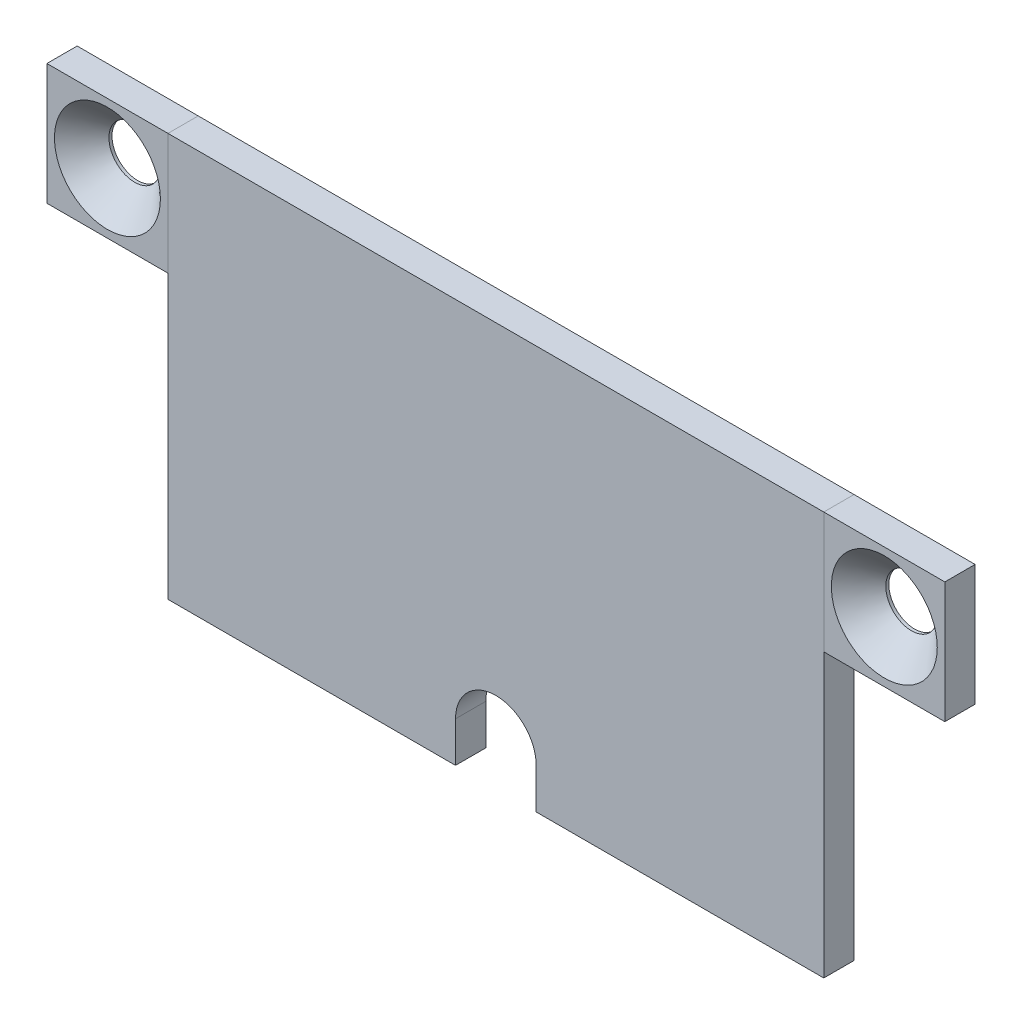
ISO-10303-21;
HEADER;
FILE_DESCRIPTION(('STEP AP214'),'2;1');
FILE_NAME('part.step','',(''),(''),'','','');
FILE_SCHEMA(('AUTOMOTIVE_DESIGN { 1 0 10303 214 1 1 1 1 }'));
ENDSEC;
DATA;
#1=APPLICATION_CONTEXT('core data for automotive mechanical design processes');
#2=APPLICATION_PROTOCOL_DEFINITION('international standard','automotive_design',2000,#1);
#3=PRODUCT_CONTEXT('',#1,'mechanical');
#4=PRODUCT('Part','Part','',(#3));
#5=PRODUCT_RELATED_PRODUCT_CATEGORY('part','',(#4));
#6=PRODUCT_DEFINITION_FORMATION('','',#4);
#7=PRODUCT_DEFINITION_CONTEXT('part definition',#1,'design');
#8=PRODUCT_DEFINITION('design','',#6,#7);
#9=PRODUCT_DEFINITION_SHAPE('','',#8);
#10=(LENGTH_UNIT() NAMED_UNIT(*) SI_UNIT(.MILLI.,.METRE.));
#11=(NAMED_UNIT(*) PLANE_ANGLE_UNIT() SI_UNIT($,.RADIAN.));
#12=(NAMED_UNIT(*) SI_UNIT($,.STERADIAN.) SOLID_ANGLE_UNIT());
#13=UNCERTAINTY_MEASURE_WITH_UNIT(LENGTH_MEASURE(1.E-05),#10,'distance_accuracy_value','');
#14=(GEOMETRIC_REPRESENTATION_CONTEXT(3) GLOBAL_UNCERTAINTY_ASSIGNED_CONTEXT((#13)) GLOBAL_UNIT_ASSIGNED_CONTEXT((#10,
#11,#12)) REPRESENTATION_CONTEXT('',''));
#15=CARTESIAN_POINT('',(0.,0.,0.));
#16=DIRECTION('',(0.,0.,1.));
#17=DIRECTION('',(1.,0.,0.));
#18=AXIS2_PLACEMENT_3D('',#15,#16,#17);
#19=CARTESIAN_POINT('',(30.0943941420636,53.1628696008408,0.));
#20=DIRECTION('',(-1.,0.,0.));
#21=DIRECTION('',(0.,0.,1.));
#22=AXIS2_PLACEMENT_3D('',#19,#20,#21);
#23=PLANE('',#22);
#24=DIRECTION('',(0.,-1.,0.));
#25=VECTOR('',#24,1.);
#26=CARTESIAN_POINT('',(30.0943941420636,53.1628696008408,3.));
#27=LINE('',#26,#25);
#28=CARTESIAN_POINT('',(30.0943941420636,53.1628696008408,3.));
#29=VERTEX_POINT('',#28);
#30=CARTESIAN_POINT('',(30.0943941420636,41.1628696008408,3.));
#31=VERTEX_POINT('',#30);
#32=EDGE_CURVE('E115',#29,#31,#27,.T.);
#33=ORIENTED_EDGE('',*,*,#32,.F.);
#34=DIRECTION('',(0.,0.,1.));
#35=VECTOR('',#34,1.);
#36=CARTESIAN_POINT('',(30.0943941420636,53.1628696008408,0.));
#37=LINE('',#36,#35);
#38=CARTESIAN_POINT('',(30.0943941420636,53.1628696008408,0.));
#39=VERTEX_POINT('',#38);
#40=EDGE_CURVE('E12',#39,#29,#37,.T.);
#41=ORIENTED_EDGE('',*,*,#40,.F.);
#42=DIRECTION('',(0.,-1.,0.));
#43=VECTOR('',#42,1.);
#44=CARTESIAN_POINT('',(30.0943941420636,53.1628696008408,0.));
#45=LINE('',#44,#43);
#46=CARTESIAN_POINT('',(30.0943941420636,41.1628696008408,0.));
#47=VERTEX_POINT('',#46);
#48=EDGE_CURVE('E108',#39,#47,#45,.T.);
#49=ORIENTED_EDGE('',*,*,#48,.T.);
#50=DIRECTION('',(0.,0.,1.));
#51=VECTOR('',#50,1.);
#52=CARTESIAN_POINT('',(30.0943941420636,41.1628696008408,0.));
#53=LINE('',#52,#51);
#54=EDGE_CURVE('E53',#47,#31,#53,.T.);
#55=ORIENTED_EDGE('',*,*,#54,.T.);
#56=EDGE_LOOP('',(#33,#41,#49,#55));
#57=FACE_BOUND('',#56,.T.);
#58=ADVANCED_FACE('F50',(#57),#23,.T.);
#59=CARTESIAN_POINT('',(30.0943941420636,53.1628696008408,0.));
#60=DIRECTION('',(0.,1.,0.));
#61=DIRECTION('',(0.,0.,1.));
#62=AXIS2_PLACEMENT_3D('',#59,#60,#61);
#63=PLANE('',#62);
#64=DIRECTION('',(-1.,0.,0.));
#65=VECTOR('',#64,1.);
#66=CARTESIAN_POINT('',(30.0943941420636,53.1628696008408,3.));
#67=LINE('',#66,#65);
#68=CARTESIAN_POINT('',(42.0943941420636,53.1628696008408,3.));
#69=VERTEX_POINT('',#68);
#70=EDGE_CURVE('E110',#69,#29,#67,.T.);
#71=ORIENTED_EDGE('',*,*,#70,.F.);
#72=DIRECTION('',(0.,0.,1.));
#73=VECTOR('',#72,1.);
#74=CARTESIAN_POINT('',(42.0943941420636,53.1628696008408,0.));
#75=LINE('',#74,#73);
#76=CARTESIAN_POINT('',(42.0943941420636,53.1628696008408,0.));
#77=VERTEX_POINT('',#76);
#78=EDGE_CURVE('E59',#77,#69,#75,.T.);
#79=ORIENTED_EDGE('',*,*,#78,.F.);
#80=DIRECTION('',(-1.,0.,0.));
#81=VECTOR('',#80,1.);
#82=CARTESIAN_POINT('',(30.0943941420636,53.1628696008408,0.));
#83=LINE('',#82,#81);
#84=EDGE_CURVE('E105',#77,#39,#83,.T.);
#85=ORIENTED_EDGE('',*,*,#84,.T.);
#86=ORIENTED_EDGE('',*,*,#40,.T.);
#87=EDGE_LOOP('',(#71,#79,#85,#86));
#88=FACE_BOUND('',#87,.T.);
#89=ADVANCED_FACE('F126',(#88),#63,.T.);
#90=CARTESIAN_POINT('',(42.0943941420636,53.1628696008408,0.));
#91=DIRECTION('',(1.,0.,0.));
#92=DIRECTION('',(0.,0.,-1.));
#93=AXIS2_PLACEMENT_3D('',#90,#91,#92);
#94=PLANE('',#93);
#95=DIRECTION('',(0.,1.,0.));
#96=VECTOR('',#95,1.);
#97=CARTESIAN_POINT('',(42.0943941420636,53.1628696008408,3.));
#98=LINE('',#97,#96);
#99=CARTESIAN_POINT('',(42.0943941420636,41.1628696008408,3.));
#100=VERTEX_POINT('',#99);
#101=EDGE_CURVE('E100',#100,#69,#98,.T.);
#102=ORIENTED_EDGE('',*,*,#101,.F.);
#103=DIRECTION('',(0.,0.,1.));
#104=VECTOR('',#103,1.);
#105=CARTESIAN_POINT('',(42.0943941420636,41.1628696008408,0.));
#106=LINE('',#105,#104);
#107=CARTESIAN_POINT('',(42.0943941420636,41.1628696008408,0.));
#108=VERTEX_POINT('',#107);
#109=EDGE_CURVE('E95',#108,#100,#106,.T.);
#110=ORIENTED_EDGE('',*,*,#109,.F.);
#111=DIRECTION('',(0.,1.,0.));
#112=VECTOR('',#111,1.);
#113=CARTESIAN_POINT('',(42.0943941420636,53.1628696008408,0.));
#114=LINE('',#113,#112);
#115=EDGE_CURVE('E98',#108,#77,#114,.T.);
#116=ORIENTED_EDGE('',*,*,#115,.T.);
#117=ORIENTED_EDGE('',*,*,#78,.T.);
#118=EDGE_LOOP('',(#102,#110,#116,#117));
#119=FACE_BOUND('',#118,.T.);
#120=ADVANCED_FACE('F97',(#119),#94,.T.);
#121=CARTESIAN_POINT('',(30.0943941420636,41.1628696008408,0.));
#122=DIRECTION('',(0.,-1.,0.));
#123=DIRECTION('',(0.,0.,-1.));
#124=AXIS2_PLACEMENT_3D('',#121,#122,#123);
#125=PLANE('',#124);
#126=DIRECTION('',(1.,0.,0.));
#127=VECTOR('',#126,1.);
#128=CARTESIAN_POINT('',(30.0943941420636,41.1628696008408,3.));
#129=LINE('',#128,#127);
#130=EDGE_CURVE('E118',#31,#100,#129,.T.);
#131=ORIENTED_EDGE('',*,*,#130,.F.);
#132=ORIENTED_EDGE('',*,*,#54,.F.);
#133=DIRECTION('',(1.,0.,0.));
#134=VECTOR('',#133,1.);
#135=CARTESIAN_POINT('',(30.0943941420636,41.1628696008408,0.));
#136=LINE('',#135,#134);
#137=EDGE_CURVE('E104',#47,#108,#136,.T.);
#138=ORIENTED_EDGE('',*,*,#137,.T.);
#139=ORIENTED_EDGE('',*,*,#109,.T.);
#140=EDGE_LOOP('',(#131,#132,#138,#139));
#141=FACE_BOUND('',#140,.T.);
#142=ADVANCED_FACE('F107',(#141),#125,.T.);
#143=CARTESIAN_POINT('',(0.,0.,0.));
#144=DIRECTION('',(0.,0.,1.));
#145=DIRECTION('',(1.,0.,0.));
#146=AXIS2_PLACEMENT_3D('',#143,#144,#145);
#147=PLANE('',#146);
#148=CARTESIAN_POINT('',(36.0943941420636,47.1628696008408,0.));
#149=DIRECTION('',(0.,0.,1.));
#150=DIRECTION('',(1.,0.,0.));
#151=AXIS2_PLACEMENT_3D('',#148,#149,#150);
#152=CIRCLE('',#151,2.54999998);
#153=CARTESIAN_POINT('',(38.6443941220636,47.1628696008408,0.));
#154=VERTEX_POINT('',#153);
#155=EDGE_CURVE('E119',#154,#154,#152,.T.);
#156=ORIENTED_EDGE('',*,*,#155,.T.);
#157=EDGE_LOOP('',(#156));
#158=FACE_BOUND('',#157,.T.);
#159=ORIENTED_EDGE('',*,*,#48,.F.);
#160=ORIENTED_EDGE('',*,*,#84,.F.);
#161=ORIENTED_EDGE('',*,*,#115,.F.);
#162=ORIENTED_EDGE('',*,*,#137,.F.);
#163=EDGE_LOOP('',(#159,#160,#161,#162));
#164=FACE_BOUND('',#163,.T.);
#165=ADVANCED_FACE('F103',(#158,#164),#147,.F.);
#166=CARTESIAN_POINT('',(0.,0.,3.));
#167=DIRECTION('',(0.,0.,1.));
#168=DIRECTION('',(1.,0.,0.));
#169=AXIS2_PLACEMENT_3D('',#166,#167,#168);
#170=PLANE('',#169);
#171=CARTESIAN_POINT('',(36.0943941420636,47.1628696008408,3.));
#172=DIRECTION('',(0.,0.,1.));
#173=DIRECTION('',(1.,0.,0.));
#174=AXIS2_PLACEMENT_3D('',#171,#172,#173);
#175=CIRCLE('',#174,5.250000041);
#176=CARTESIAN_POINT('',(41.3443941830636,47.1628696008408,3.));
#177=VERTEX_POINT('',#176);
#178=EDGE_CURVE('E162',#177,#177,#175,.T.);
#179=ORIENTED_EDGE('',*,*,#178,.F.);
#180=EDGE_LOOP('',(#179));
#181=FACE_BOUND('',#180,.T.);
#182=ORIENTED_EDGE('',*,*,#32,.T.);
#183=ORIENTED_EDGE('',*,*,#130,.T.);
#184=ORIENTED_EDGE('',*,*,#101,.T.);
#185=ORIENTED_EDGE('',*,*,#70,.T.);
#186=EDGE_LOOP('',(#182,#183,#184,#185));
#187=FACE_BOUND('',#186,.T.);
#188=ADVANCED_FACE('F125',(#181,#187),#170,.T.);
#189=CARTESIAN_POINT('',(36.0943941420636,47.1628696008408,3.));
#190=DIRECTION('',(0.,0.,1.));
#191=DIRECTION('',(1.,0.,0.));
#192=AXIS2_PLACEMENT_3D('',#189,#190,#191);
#193=CYLINDRICAL_SURFACE('',#192,2.54999998);
#194=ORIENTED_EDGE('',*,*,#155,.F.);
#195=EDGE_LOOP('',(#194));
#196=FACE_BOUND('',#195,.T.);
#197=CARTESIAN_POINT('',(36.0943941420636,47.1628696008408,0.299999939000002));
#198=DIRECTION('',(0.,0.,1.));
#199=DIRECTION('',(1.,0.,0.));
#200=AXIS2_PLACEMENT_3D('',#197,#198,#199);
#201=CIRCLE('',#200,2.54999998);
#202=CARTESIAN_POINT('',(38.6443941220636,47.1628696008408,0.299999939000002));
#203=VERTEX_POINT('',#202);
#204=EDGE_CURVE('E159',#203,#203,#201,.T.);
#205=ORIENTED_EDGE('',*,*,#204,.T.);
#206=EDGE_LOOP('',(#205));
#207=FACE_BOUND('',#206,.T.);
#208=ADVANCED_FACE('F144',(#196,#207),#193,.F.);
#209=CARTESIAN_POINT('',(36.0943941420636,47.1628696008408,3.));
#210=DIRECTION('',(0.,0.,1.));
#211=DIRECTION('',(1.,0.,0.));
#212=AXIS2_PLACEMENT_3D('',#209,#210,#211);
#213=CONICAL_SURFACE('',#212,5.250000041,0.785398163397448);
#214=ORIENTED_EDGE('',*,*,#204,.F.);
#215=EDGE_LOOP('',(#214));
#216=FACE_BOUND('',#215,.T.);
#217=ORIENTED_EDGE('',*,*,#178,.T.);
#218=EDGE_LOOP('',(#217));
#219=FACE_BOUND('',#218,.T.);
#220=ADVANCED_FACE('F150',(#216,#219),#213,.F.);
#221=CLOSED_SHELL('',(#58,#89,#120,#142,#165,#188,#208,#220));
#222=MANIFOLD_SOLID_BREP('B2',#221);
#223=CARTESIAN_POINT('',(-34.9056058579364,53.1628696008408,0.));
#224=DIRECTION('',(1.,0.,0.));
#225=DIRECTION('',(0.,0.,-1.));
#226=AXIS2_PLACEMENT_3D('',#223,#224,#225);
#227=PLANE('',#226);
#228=DIRECTION('',(0.,1.,0.));
#229=VECTOR('',#228,1.);
#230=CARTESIAN_POINT('',(-34.9056058579364,53.1628696008408,3.));
#231=LINE('',#230,#229);
#232=CARTESIAN_POINT('',(-34.9056058579364,41.1628696008408,3.));
#233=VERTEX_POINT('',#232);
#234=CARTESIAN_POINT('',(-34.9056058579364,53.1628696008408,3.));
#235=VERTEX_POINT('',#234);
#236=EDGE_CURVE('E284',#233,#235,#231,.T.);
#237=ORIENTED_EDGE('',*,*,#236,.F.);
#238=DIRECTION('',(0.,0.,1.));
#239=VECTOR('',#238,1.);
#240=CARTESIAN_POINT('',(-34.9056058579364,41.1628696008408,0.));
#241=LINE('',#240,#239);
#242=CARTESIAN_POINT('',(-34.9056058579364,41.1628696008408,0.));
#243=VERTEX_POINT('',#242);
#244=EDGE_CURVE('E48',#243,#233,#241,.T.);
#245=ORIENTED_EDGE('',*,*,#244,.F.);
#246=DIRECTION('',(0.,1.,0.));
#247=VECTOR('',#246,1.);
#248=CARTESIAN_POINT('',(-34.9056058579364,53.1628696008408,0.));
#249=LINE('',#248,#247);
#250=CARTESIAN_POINT('',(-34.9056058579364,53.1628696008408,0.));
#251=VERTEX_POINT('',#250);
#252=EDGE_CURVE('E277',#243,#251,#249,.T.);
#253=ORIENTED_EDGE('',*,*,#252,.T.);
#254=DIRECTION('',(0.,0.,1.));
#255=VECTOR('',#254,1.);
#256=CARTESIAN_POINT('',(-34.9056058579364,53.1628696008408,0.));
#257=LINE('',#256,#255);
#258=EDGE_CURVE('E222',#251,#235,#257,.T.);
#259=ORIENTED_EDGE('',*,*,#258,.T.);
#260=EDGE_LOOP('',(#237,#245,#253,#259));
#261=FACE_BOUND('',#260,.T.);
#262=ADVANCED_FACE('F219',(#261),#227,.T.);
#263=CARTESIAN_POINT('',(-34.9056058579364,41.1628696008408,0.));
#264=DIRECTION('',(0.,-1.,0.));
#265=DIRECTION('',(0.,0.,-1.));
#266=AXIS2_PLACEMENT_3D('',#263,#264,#265);
#267=PLANE('',#266);
#268=DIRECTION('',(1.,0.,0.));
#269=VECTOR('',#268,1.);
#270=CARTESIAN_POINT('',(-34.9056058579364,41.1628696008408,3.));
#271=LINE('',#270,#269);
#272=CARTESIAN_POINT('',(-46.9056058579364,41.1628696008408,3.));
#273=VERTEX_POINT('',#272);
#274=EDGE_CURVE('E279',#273,#233,#271,.T.);
#275=ORIENTED_EDGE('',*,*,#274,.F.);
#276=DIRECTION('',(0.,0.,1.));
#277=VECTOR('',#276,1.);
#278=CARTESIAN_POINT('',(-46.9056058579364,41.1628696008408,0.));
#279=LINE('',#278,#277);
#280=CARTESIAN_POINT('',(-46.9056058579364,41.1628696008408,0.));
#281=VERTEX_POINT('',#280);
#282=EDGE_CURVE('E228',#281,#273,#279,.T.);
#283=ORIENTED_EDGE('',*,*,#282,.F.);
#284=DIRECTION('',(1.,0.,0.));
#285=VECTOR('',#284,1.);
#286=CARTESIAN_POINT('',(-34.9056058579364,41.1628696008408,0.));
#287=LINE('',#286,#285);
#288=EDGE_CURVE('E274',#281,#243,#287,.T.);
#289=ORIENTED_EDGE('',*,*,#288,.T.);
#290=ORIENTED_EDGE('',*,*,#244,.T.);
#291=EDGE_LOOP('',(#275,#283,#289,#290));
#292=FACE_BOUND('',#291,.T.);
#293=ADVANCED_FACE('F295',(#292),#267,.T.);
#294=CARTESIAN_POINT('',(-46.9056058579364,53.1628696008408,0.));
#295=DIRECTION('',(-1.,0.,0.));
#296=DIRECTION('',(0.,0.,1.));
#297=AXIS2_PLACEMENT_3D('',#294,#295,#296);
#298=PLANE('',#297);
#299=DIRECTION('',(0.,-1.,0.));
#300=VECTOR('',#299,1.);
#301=CARTESIAN_POINT('',(-46.9056058579364,53.1628696008408,3.));
#302=LINE('',#301,#300);
#303=CARTESIAN_POINT('',(-46.9056058579364,53.1628696008408,3.));
#304=VERTEX_POINT('',#303);
#305=EDGE_CURVE('E269',#304,#273,#302,.T.);
#306=ORIENTED_EDGE('',*,*,#305,.F.);
#307=DIRECTION('',(0.,0.,1.));
#308=VECTOR('',#307,1.);
#309=CARTESIAN_POINT('',(-46.9056058579364,53.1628696008408,0.));
#310=LINE('',#309,#308);
#311=CARTESIAN_POINT('',(-46.9056058579364,53.1628696008408,0.));
#312=VERTEX_POINT('',#311);
#313=EDGE_CURVE('E264',#312,#304,#310,.T.);
#314=ORIENTED_EDGE('',*,*,#313,.F.);
#315=DIRECTION('',(0.,-1.,0.));
#316=VECTOR('',#315,1.);
#317=CARTESIAN_POINT('',(-46.9056058579364,53.1628696008408,0.));
#318=LINE('',#317,#316);
#319=EDGE_CURVE('E267',#312,#281,#318,.T.);
#320=ORIENTED_EDGE('',*,*,#319,.T.);
#321=ORIENTED_EDGE('',*,*,#282,.T.);
#322=EDGE_LOOP('',(#306,#314,#320,#321));
#323=FACE_BOUND('',#322,.T.);
#324=ADVANCED_FACE('F266',(#323),#298,.T.);
#325=CARTESIAN_POINT('',(-34.9056058579364,53.1628696008408,0.));
#326=DIRECTION('',(0.,1.,0.));
#327=DIRECTION('',(0.,0.,1.));
#328=AXIS2_PLACEMENT_3D('',#325,#326,#327);
#329=PLANE('',#328);
#330=DIRECTION('',(-1.,0.,0.));
#331=VECTOR('',#330,1.);
#332=CARTESIAN_POINT('',(-34.9056058579364,53.1628696008408,3.));
#333=LINE('',#332,#331);
#334=EDGE_CURVE('E287',#235,#304,#333,.T.);
#335=ORIENTED_EDGE('',*,*,#334,.F.);
#336=ORIENTED_EDGE('',*,*,#258,.F.);
#337=DIRECTION('',(-1.,0.,0.));
#338=VECTOR('',#337,1.);
#339=CARTESIAN_POINT('',(-34.9056058579364,53.1628696008408,0.));
#340=LINE('',#339,#338);
#341=EDGE_CURVE('E273',#251,#312,#340,.T.);
#342=ORIENTED_EDGE('',*,*,#341,.T.);
#343=ORIENTED_EDGE('',*,*,#313,.T.);
#344=EDGE_LOOP('',(#335,#336,#342,#343));
#345=FACE_BOUND('',#344,.T.);
#346=ADVANCED_FACE('F276',(#345),#329,.T.);
#347=CARTESIAN_POINT('',(0.,0.,0.));
#348=DIRECTION('',(0.,0.,-1.));
#349=DIRECTION('',(-1.,0.,0.));
#350=AXIS2_PLACEMENT_3D('',#347,#348,#349);
#351=PLANE('',#350);
#352=CARTESIAN_POINT('',(-40.9056058579364,47.1628696008408,0.));
#353=DIRECTION('',(0.,0.,1.));
#354=DIRECTION('',(1.,0.,0.));
#355=AXIS2_PLACEMENT_3D('',#352,#353,#354);
#356=CIRCLE('',#355,2.54999998);
#357=CARTESIAN_POINT('',(-38.3556058779364,47.1628696008408,0.));
#358=VERTEX_POINT('',#357);
#359=EDGE_CURVE('E288',#358,#358,#356,.T.);
#360=ORIENTED_EDGE('',*,*,#359,.T.);
#361=EDGE_LOOP('',(#360));
#362=FACE_BOUND('',#361,.T.);
#363=ORIENTED_EDGE('',*,*,#252,.F.);
#364=ORIENTED_EDGE('',*,*,#288,.F.);
#365=ORIENTED_EDGE('',*,*,#319,.F.);
#366=ORIENTED_EDGE('',*,*,#341,.F.);
#367=EDGE_LOOP('',(#363,#364,#365,#366));
#368=FACE_BOUND('',#367,.T.);
#369=ADVANCED_FACE('F272',(#362,#368),#351,.T.);
#370=CARTESIAN_POINT('',(0.,0.,3.));
#371=DIRECTION('',(0.,0.,-1.));
#372=DIRECTION('',(-1.,0.,0.));
#373=AXIS2_PLACEMENT_3D('',#370,#371,#372);
#374=PLANE('',#373);
#375=CARTESIAN_POINT('',(-40.9056058579364,47.1628696008408,3.));
#376=DIRECTION('',(0.,0.,1.));
#377=DIRECTION('',(1.,0.,0.));
#378=AXIS2_PLACEMENT_3D('',#375,#376,#377);
#379=CIRCLE('',#378,5.250000041);
#380=CARTESIAN_POINT('',(-35.6556058169364,47.1628696008408,3.));
#381=VERTEX_POINT('',#380);
#382=EDGE_CURVE('E331',#381,#381,#379,.T.);
#383=ORIENTED_EDGE('',*,*,#382,.F.);
#384=EDGE_LOOP('',(#383));
#385=FACE_BOUND('',#384,.T.);
#386=ORIENTED_EDGE('',*,*,#236,.T.);
#387=ORIENTED_EDGE('',*,*,#334,.T.);
#388=ORIENTED_EDGE('',*,*,#305,.T.);
#389=ORIENTED_EDGE('',*,*,#274,.T.);
#390=EDGE_LOOP('',(#386,#387,#388,#389));
#391=FACE_BOUND('',#390,.T.);
#392=ADVANCED_FACE('F294',(#385,#391),#374,.F.);
#393=CARTESIAN_POINT('',(-40.9056058579364,47.1628696008408,3.));
#394=DIRECTION('',(0.,0.,1.));
#395=DIRECTION('',(1.,0.,0.));
#396=AXIS2_PLACEMENT_3D('',#393,#394,#395);
#397=CYLINDRICAL_SURFACE('',#396,2.54999998);
#398=ORIENTED_EDGE('',*,*,#359,.F.);
#399=EDGE_LOOP('',(#398));
#400=FACE_BOUND('',#399,.T.);
#401=CARTESIAN_POINT('',(-40.9056058579364,47.1628696008408,0.299999939000002));
#402=DIRECTION('',(0.,0.,1.));
#403=DIRECTION('',(1.,0.,0.));
#404=AXIS2_PLACEMENT_3D('',#401,#402,#403);
#405=CIRCLE('',#404,2.54999998);
#406=CARTESIAN_POINT('',(-38.3556058779364,47.1628696008408,0.299999939000002));
#407=VERTEX_POINT('',#406);
#408=EDGE_CURVE('E328',#407,#407,#405,.T.);
#409=ORIENTED_EDGE('',*,*,#408,.T.);
#410=EDGE_LOOP('',(#409));
#411=FACE_BOUND('',#410,.T.);
#412=ADVANCED_FACE('F313',(#400,#411),#397,.F.);
#413=CARTESIAN_POINT('',(-40.9056058579364,47.1628696008408,3.));
#414=DIRECTION('',(0.,0.,1.));
#415=DIRECTION('',(1.,0.,0.));
#416=AXIS2_PLACEMENT_3D('',#413,#414,#415);
#417=CONICAL_SURFACE('',#416,5.250000041,0.785398163397448);
#418=ORIENTED_EDGE('',*,*,#408,.F.);
#419=EDGE_LOOP('',(#418));
#420=FACE_BOUND('',#419,.T.);
#421=ORIENTED_EDGE('',*,*,#382,.T.);
#422=EDGE_LOOP('',(#421));
#423=FACE_BOUND('',#422,.T.);
#424=ADVANCED_FACE('F319',(#420,#423),#417,.F.);
#425=CLOSED_SHELL('',(#262,#293,#324,#346,#369,#392,#412,#424));
#426=MANIFOLD_SOLID_BREP('B6',#425);
#427=CARTESIAN_POINT('',(-34.9056058579364,13.1628696008408,3.));
#428=DIRECTION('',(0.,1.,0.));
#429=DIRECTION('',(0.,0.,1.));
#430=AXIS2_PLACEMENT_3D('',#427,#428,#429);
#431=PLANE('',#430);
#432=DIRECTION('',(1.,0.,0.));
#433=VECTOR('',#432,1.);
#434=CARTESIAN_POINT('',(-34.9056058579364,13.1628696008408,3.));
#435=LINE('',#434,#433);
#436=CARTESIAN_POINT('',(1.59439414206361,13.1628696008408,3.));
#437=VERTEX_POINT('',#436);
#438=CARTESIAN_POINT('',(30.0943941420636,13.1628696008408,3.));
#439=VERTEX_POINT('',#438);
#440=EDGE_CURVE('E500',#437,#439,#435,.T.);
#441=ORIENTED_EDGE('',*,*,#440,.F.);
#442=DIRECTION('',(0.,0.,1.));
#443=VECTOR('',#442,1.);
#444=CARTESIAN_POINT('',(1.59439414206361,13.1628696008408,0.));
#445=LINE('',#444,#443);
#446=CARTESIAN_POINT('',(1.59439414206361,13.1628696008408,0.));
#447=VERTEX_POINT('',#446);
#448=EDGE_CURVE('E492',#447,#437,#445,.T.);
#449=ORIENTED_EDGE('',*,*,#448,.F.);
#450=DIRECTION('',(1.,0.,0.));
#451=VECTOR('',#450,1.);
#452=CARTESIAN_POINT('',(-34.9056058579364,13.1628696008408,0.));
#453=LINE('',#452,#451);
#454=CARTESIAN_POINT('',(30.0943941420636,13.1628696008408,0.));
#455=VERTEX_POINT('',#454);
#456=EDGE_CURVE('E512',#447,#455,#453,.T.);
#457=ORIENTED_EDGE('',*,*,#456,.T.);
#458=DIRECTION('',(0.,0.,-1.));
#459=VECTOR('',#458,1.);
#460=CARTESIAN_POINT('',(30.0943941420636,13.1628696008408,3.));
#461=LINE('',#460,#459);
#462=EDGE_CURVE('E388',#439,#455,#461,.T.);
#463=ORIENTED_EDGE('',*,*,#462,.F.);
#464=EDGE_LOOP('',(#441,#449,#457,#463));
#465=FACE_BOUND('',#464,.T.);
#466=ADVANCED_FACE('F379',(#465),#431,.F.);
#467=CARTESIAN_POINT('',(-34.9056058579364,53.1628696008408,3.));
#468=DIRECTION('',(1.,0.,0.));
#469=DIRECTION('',(0.,0.,-1.));
#470=AXIS2_PLACEMENT_3D('',#467,#468,#469);
#471=PLANE('',#470);
#472=DIRECTION('',(0.,-1.,0.));
#473=VECTOR('',#472,1.);
#474=CARTESIAN_POINT('',(-34.9056058579364,53.1628696008408,0.));
#475=LINE('',#474,#473);
#476=CARTESIAN_POINT('',(-34.9056058579364,53.1628696008408,0.));
#477=VERTEX_POINT('',#476);
#478=CARTESIAN_POINT('',(-34.9056058579364,13.1628696008408,0.));
#479=VERTEX_POINT('',#478);
#480=EDGE_CURVE('E491',#477,#479,#475,.T.);
#481=ORIENTED_EDGE('',*,*,#480,.T.);
#482=DIRECTION('',(0.,0.,-1.));
#483=VECTOR('',#482,1.);
#484=CARTESIAN_POINT('',(-34.9056058579364,13.1628696008408,3.));
#485=LINE('',#484,#483);
#486=CARTESIAN_POINT('',(-34.9056058579364,13.1628696008408,3.));
#487=VERTEX_POINT('',#486);
#488=EDGE_CURVE('E217',#487,#479,#485,.T.);
#489=ORIENTED_EDGE('',*,*,#488,.F.);
#490=DIRECTION('',(0.,-1.,0.));
#491=VECTOR('',#490,1.);
#492=CARTESIAN_POINT('',(-34.9056058579364,53.1628696008408,3.));
#493=LINE('',#492,#491);
#494=CARTESIAN_POINT('',(-34.9056058579364,53.1628696008408,3.));
#495=VERTEX_POINT('',#494);
#496=EDGE_CURVE('E497',#495,#487,#493,.T.);
#497=ORIENTED_EDGE('',*,*,#496,.F.);
#498=DIRECTION('',(0.,0.,-1.));
#499=VECTOR('',#498,1.);
#500=CARTESIAN_POINT('',(-34.9056058579364,53.1628696008408,3.));
#501=LINE('',#500,#499);
#502=EDGE_CURVE('E508',#495,#477,#501,.T.);
#503=ORIENTED_EDGE('',*,*,#502,.T.);
#504=EDGE_LOOP('',(#481,#489,#497,#503));
#505=FACE_BOUND('',#504,.T.);
#506=ADVANCED_FACE('F381',(#505),#471,.F.);
#507=CARTESIAN_POINT('',(-6.4056058579364,13.1628696008408,0.));
#508=VERTEX_POINT('',#507);
#509=EDGE_CURVE('E513',#479,#508,#453,.T.);
#510=ORIENTED_EDGE('',*,*,#509,.T.);
#511=DIRECTION('',(0.,0.,1.));
#512=VECTOR('',#511,1.);
#513=CARTESIAN_POINT('',(-6.4056058579364,13.1628696008408,0.));
#514=LINE('',#513,#512);
#515=CARTESIAN_POINT('',(-6.4056058579364,13.1628696008408,3.));
#516=VERTEX_POINT('',#515);
#517=EDGE_CURVE('E395',#508,#516,#514,.T.);
#518=ORIENTED_EDGE('',*,*,#517,.T.);
#519=EDGE_CURVE('E431',#487,#516,#435,.T.);
#520=ORIENTED_EDGE('',*,*,#519,.F.);
#521=ORIENTED_EDGE('',*,*,#488,.T.);
#522=EDGE_LOOP('',(#510,#518,#520,#521));
#523=FACE_BOUND('',#522,.T.);
#524=ADVANCED_FACE('F548',(#523),#431,.F.);
#525=CARTESIAN_POINT('',(30.0943941420636,53.1628696008408,3.));
#526=DIRECTION('',(-1.,0.,0.));
#527=DIRECTION('',(0.,0.,1.));
#528=AXIS2_PLACEMENT_3D('',#525,#526,#527);
#529=PLANE('',#528);
#530=DIRECTION('',(0.,1.,0.));
#531=VECTOR('',#530,1.);
#532=CARTESIAN_POINT('',(30.0943941420636,53.1628696008408,0.));
#533=LINE('',#532,#531);
#534=CARTESIAN_POINT('',(30.0943941420636,53.1628696008408,0.));
#535=VERTEX_POINT('',#534);
#536=EDGE_CURVE('E516',#455,#535,#533,.T.);
#537=ORIENTED_EDGE('',*,*,#536,.T.);
#538=DIRECTION('',(0.,0.,-1.));
#539=VECTOR('',#538,1.);
#540=CARTESIAN_POINT('',(30.0943941420636,53.1628696008408,3.));
#541=LINE('',#540,#539);
#542=CARTESIAN_POINT('',(30.0943941420636,53.1628696008408,3.));
#543=VERTEX_POINT('',#542);
#544=EDGE_CURVE('E523',#543,#535,#541,.T.);
#545=ORIENTED_EDGE('',*,*,#544,.F.);
#546=DIRECTION('',(0.,1.,0.));
#547=VECTOR('',#546,1.);
#548=CARTESIAN_POINT('',(30.0943941420636,53.1628696008408,3.));
#549=LINE('',#548,#547);
#550=EDGE_CURVE('E503',#439,#543,#549,.T.);
#551=ORIENTED_EDGE('',*,*,#550,.F.);
#552=ORIENTED_EDGE('',*,*,#462,.T.);
#553=EDGE_LOOP('',(#537,#545,#551,#552));
#554=FACE_BOUND('',#553,.T.);
#555=ADVANCED_FACE('F531',(#554),#529,.F.);
#556=CARTESIAN_POINT('',(-34.9056058579364,53.1628696008408,3.));
#557=DIRECTION('',(0.,-1.,0.));
#558=DIRECTION('',(0.,0.,-1.));
#559=AXIS2_PLACEMENT_3D('',#556,#557,#558);
#560=PLANE('',#559);
#561=DIRECTION('',(-1.,0.,0.));
#562=VECTOR('',#561,1.);
#563=CARTESIAN_POINT('',(-34.9056058579364,53.1628696008408,0.));
#564=LINE('',#563,#562);
#565=EDGE_CURVE('E425',#535,#477,#564,.T.);
#566=ORIENTED_EDGE('',*,*,#565,.T.);
#567=ORIENTED_EDGE('',*,*,#502,.F.);
#568=DIRECTION('',(-1.,0.,0.));
#569=VECTOR('',#568,1.);
#570=CARTESIAN_POINT('',(-34.9056058579364,53.1628696008408,3.));
#571=LINE('',#570,#569);
#572=EDGE_CURVE('E404',#543,#495,#571,.T.);
#573=ORIENTED_EDGE('',*,*,#572,.F.);
#574=ORIENTED_EDGE('',*,*,#544,.T.);
#575=EDGE_LOOP('',(#566,#567,#573,#574));
#576=FACE_BOUND('',#575,.T.);
#577=ADVANCED_FACE('F539',(#576),#560,.F.);
#578=CARTESIAN_POINT('',(0.,0.,3.));
#579=DIRECTION('',(0.,0.,1.));
#580=DIRECTION('',(1.,0.,0.));
#581=AXIS2_PLACEMENT_3D('',#578,#579,#580);
#582=PLANE('',#581);
#583=DIRECTION('',(0.,1.,0.));
#584=VECTOR('',#583,1.);
#585=CARTESIAN_POINT('',(1.59439414206361,17.162868612189,3.));
#586=LINE('',#585,#584);
#587=CARTESIAN_POINT('',(1.59439414206361,17.162868612189,3.));
#588=VERTEX_POINT('',#587);
#589=EDGE_CURVE('E475',#437,#588,#586,.T.);
#590=ORIENTED_EDGE('',*,*,#589,.F.);
#591=ORIENTED_EDGE('',*,*,#440,.T.);
#592=ORIENTED_EDGE('',*,*,#550,.T.);
#593=ORIENTED_EDGE('',*,*,#572,.T.);
#594=ORIENTED_EDGE('',*,*,#496,.T.);
#595=ORIENTED_EDGE('',*,*,#519,.T.);
#596=DIRECTION('',(0.,-1.,0.));
#597=VECTOR('',#596,1.);
#598=CARTESIAN_POINT('',(-6.4056058579364,17.1628696008408,3.));
#599=LINE('',#598,#597);
#600=CARTESIAN_POINT('',(-6.4056058579364,17.1628696008408,3.));
#601=VERTEX_POINT('',#600);
#602=EDGE_CURVE('E479',#601,#516,#599,.T.);
#603=ORIENTED_EDGE('',*,*,#602,.F.);
#604=CARTESIAN_POINT('',(-2.40560585793639,17.1628691065149,3.));
#605=DIRECTION('',(0.,0.,1.));
#606=DIRECTION('',(-1.,0.,0.));
#607=AXIS2_PLACEMENT_3D('',#604,#605,#606);
#608=CIRCLE('',#607,4.00000000000004);
#609=EDGE_CURVE('E461',#588,#601,#608,.T.);
#610=ORIENTED_EDGE('',*,*,#609,.F.);
#611=EDGE_LOOP('',(#590,#591,#592,#593,#594,#595,#603,#610));
#612=FACE_BOUND('',#611,.T.);
#613=ADVANCED_FACE('F541',(#612),#582,.T.);
#614=CARTESIAN_POINT('',(0.,0.,0.));
#615=DIRECTION('',(0.,0.,1.));
#616=DIRECTION('',(1.,0.,0.));
#617=AXIS2_PLACEMENT_3D('',#614,#615,#616);
#618=PLANE('',#617);
#619=ORIENTED_EDGE('',*,*,#456,.F.);
#620=DIRECTION('',(0.,1.,0.));
#621=VECTOR('',#620,1.);
#622=CARTESIAN_POINT('',(1.59439414206361,17.162868612189,0.));
#623=LINE('',#622,#621);
#624=CARTESIAN_POINT('',(1.59439414206361,17.162868612189,0.));
#625=VERTEX_POINT('',#624);
#626=EDGE_CURVE('E464',#447,#625,#623,.T.);
#627=ORIENTED_EDGE('',*,*,#626,.T.);
#628=CARTESIAN_POINT('',(-2.40560585793639,17.1628691065149,0.));
#629=DIRECTION('',(0.,0.,1.));
#630=DIRECTION('',(-1.,0.,0.));
#631=AXIS2_PLACEMENT_3D('',#628,#629,#630);
#632=CIRCLE('',#631,4.00000000000004);
#633=CARTESIAN_POINT('',(-6.4056058579364,17.1628696008408,0.));
#634=VERTEX_POINT('',#633);
#635=EDGE_CURVE('E458',#625,#634,#632,.T.);
#636=ORIENTED_EDGE('',*,*,#635,.T.);
#637=DIRECTION('',(0.,-1.,0.));
#638=VECTOR('',#637,1.);
#639=CARTESIAN_POINT('',(-6.4056058579364,17.1628696008408,0.));
#640=LINE('',#639,#638);
#641=EDGE_CURVE('E466',#634,#508,#640,.T.);
#642=ORIENTED_EDGE('',*,*,#641,.T.);
#643=ORIENTED_EDGE('',*,*,#509,.F.);
#644=ORIENTED_EDGE('',*,*,#480,.F.);
#645=ORIENTED_EDGE('',*,*,#565,.F.);
#646=ORIENTED_EDGE('',*,*,#536,.F.);
#647=EDGE_LOOP('',(#619,#627,#636,#642,#643,#644,#645,#646));
#648=FACE_BOUND('',#647,.T.);
#649=ADVANCED_FACE('F473',(#648),#618,.F.);
#650=CARTESIAN_POINT('',(-2.40560585793639,17.1628691065149,0.));
#651=DIRECTION('',(0.,0.,1.));
#652=DIRECTION('',(1.,0.,0.));
#653=AXIS2_PLACEMENT_3D('',#650,#651,#652);
#654=CYLINDRICAL_SURFACE('',#653,4.00000000000004);
#655=ORIENTED_EDGE('',*,*,#609,.T.);
#656=DIRECTION('',(0.,0.,1.));
#657=VECTOR('',#656,1.);
#658=CARTESIAN_POINT('',(-6.4056058579364,17.1628696008408,0.));
#659=LINE('',#658,#657);
#660=EDGE_CURVE('E455',#634,#601,#659,.T.);
#661=ORIENTED_EDGE('',*,*,#660,.F.);
#662=ORIENTED_EDGE('',*,*,#635,.F.);
#663=DIRECTION('',(0.,0.,1.));
#664=VECTOR('',#663,1.);
#665=CARTESIAN_POINT('',(1.59439414206361,17.162868612189,0.));
#666=LINE('',#665,#664);
#667=EDGE_CURVE('E488',#625,#588,#666,.T.);
#668=ORIENTED_EDGE('',*,*,#667,.T.);
#669=EDGE_LOOP('',(#655,#661,#662,#668));
#670=FACE_BOUND('',#669,.T.);
#671=ADVANCED_FACE('F456',(#670),#654,.F.);
#672=CARTESIAN_POINT('',(1.59439414206361,17.162868612189,0.));
#673=DIRECTION('',(1.,0.,0.));
#674=DIRECTION('',(0.,1.,0.));
#675=AXIS2_PLACEMENT_3D('',#672,#673,#674);
#676=PLANE('',#675);
#677=ORIENTED_EDGE('',*,*,#589,.T.);
#678=ORIENTED_EDGE('',*,*,#667,.F.);
#679=ORIENTED_EDGE('',*,*,#626,.F.);
#680=ORIENTED_EDGE('',*,*,#448,.T.);
#681=EDGE_LOOP('',(#677,#678,#679,#680));
#682=FACE_BOUND('',#681,.T.);
#683=ADVANCED_FACE('F563',(#682),#676,.F.);
#684=CARTESIAN_POINT('',(-6.4056058579364,17.1628696008408,0.));
#685=DIRECTION('',(-1.,0.,0.));
#686=DIRECTION('',(0.,-1.,0.));
#687=AXIS2_PLACEMENT_3D('',#684,#685,#686);
#688=PLANE('',#687);
#689=ORIENTED_EDGE('',*,*,#602,.T.);
#690=ORIENTED_EDGE('',*,*,#517,.F.);
#691=ORIENTED_EDGE('',*,*,#641,.F.);
#692=ORIENTED_EDGE('',*,*,#660,.T.);
#693=EDGE_LOOP('',(#689,#690,#691,#692));
#694=FACE_BOUND('',#693,.T.);
#695=ADVANCED_FACE('F467',(#694),#688,.F.);
#696=CLOSED_SHELL('',(#466,#506,#524,#555,#577,#613,#649,#671,#683,#695));
#697=MANIFOLD_SOLID_BREP('B42',#696);
#698=ADVANCED_BREP_SHAPE_REPRESENTATION('',(#18,#222,#426,#697),#14);
#699=SHAPE_DEFINITION_REPRESENTATION(#9,#698);
ENDSEC;
END-ISO-10303-21;
